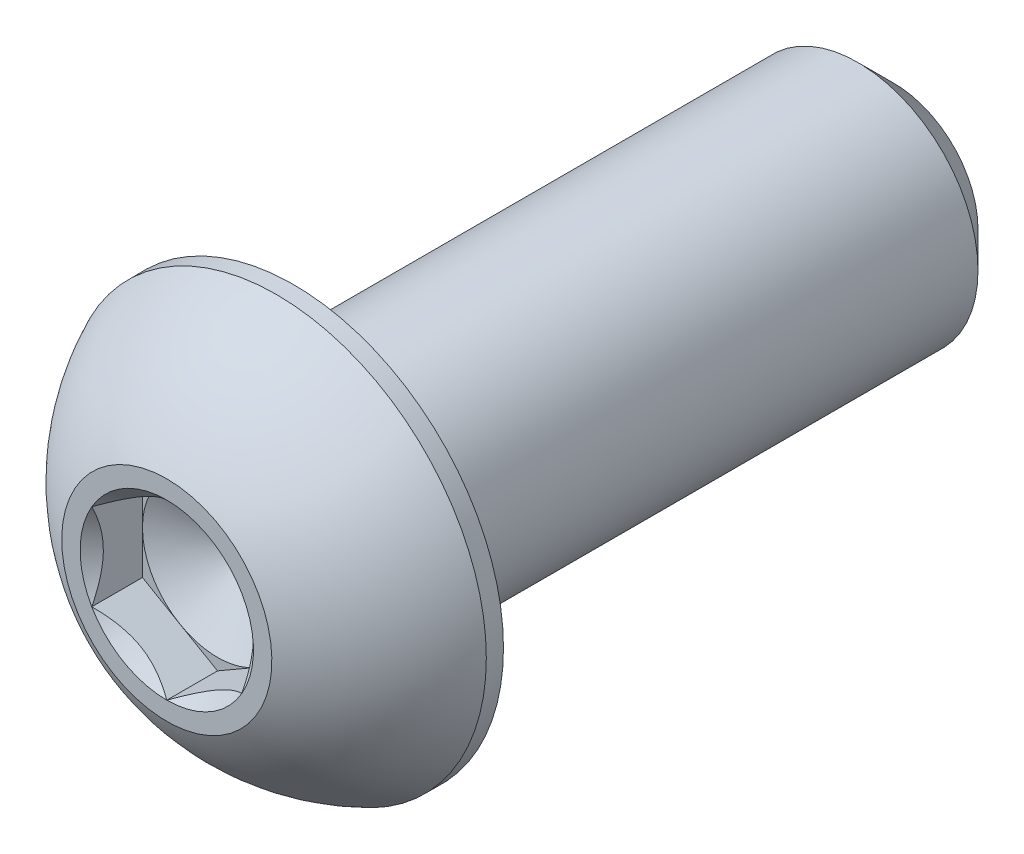
ISO-10303-21;
HEADER;
FILE_DESCRIPTION(('STEP AP214'),'2;1');
FILE_NAME('part.step','',(''),(''),'','','');
FILE_SCHEMA(('AUTOMOTIVE_DESIGN { 1 0 10303 214 1 1 1 1 }'));
ENDSEC;
DATA;
#1=APPLICATION_CONTEXT('core data for automotive mechanical design processes');
#2=APPLICATION_PROTOCOL_DEFINITION('international standard','automotive_design',2000,#1);
#3=PRODUCT_CONTEXT('',#1,'mechanical');
#4=PRODUCT('Part','Part','',(#3));
#5=PRODUCT_RELATED_PRODUCT_CATEGORY('part','',(#4));
#6=PRODUCT_DEFINITION_FORMATION('','',#4);
#7=PRODUCT_DEFINITION_CONTEXT('part definition',#1,'design');
#8=PRODUCT_DEFINITION('design','',#6,#7);
#9=PRODUCT_DEFINITION_SHAPE('','',#8);
#10=(LENGTH_UNIT() NAMED_UNIT(*) SI_UNIT(.MILLI.,.METRE.));
#11=(NAMED_UNIT(*) PLANE_ANGLE_UNIT() SI_UNIT($,.RADIAN.));
#12=(NAMED_UNIT(*) SI_UNIT($,.STERADIAN.) SOLID_ANGLE_UNIT());
#13=UNCERTAINTY_MEASURE_WITH_UNIT(LENGTH_MEASURE(1.E-05),#10,'distance_accuracy_value','');
#14=(GEOMETRIC_REPRESENTATION_CONTEXT(3) GLOBAL_UNCERTAINTY_ASSIGNED_CONTEXT((#13)) GLOBAL_UNIT_ASSIGNED_CONTEXT((#10,
#11,#12)) REPRESENTATION_CONTEXT('',''));
#15=CARTESIAN_POINT('',(0.,0.,0.));
#16=DIRECTION('',(0.,0.,1.));
#17=DIRECTION('',(1.,0.,0.));
#18=AXIS2_PLACEMENT_3D('',#15,#16,#17);
#19=CARTESIAN_POINT('',(0.,1.984375,9.6139));
#20=DIRECTION('',(0.,0.,-1.));
#21=DIRECTION('',(-1.,0.,0.));
#22=AXIS2_PLACEMENT_3D('',#19,#20,#21);
#23=PLANE('',#22);
#24=CARTESIAN_POINT('',(0.,0.,9.6139));
#25=DIRECTION('',(0.,0.,1.));
#26=DIRECTION('',(1.,0.,0.));
#27=AXIS2_PLACEMENT_3D('',#24,#25,#26);
#28=CIRCLE('',#27,2.778125);
#29=CARTESIAN_POINT('',(0.,2.778125,9.6139));
#30=VERTEX_POINT('',#29);
#31=EDGE_CURVE('E169',#30,#30,#28,.T.);
#32=ORIENTED_EDGE('',*,*,#31,.T.);
#33=EDGE_LOOP('',(#32));
#34=FACE_BOUND('',#33,.T.);
#35=CARTESIAN_POINT('',(0.,0.,9.6139));
#36=DIRECTION('',(0.,0.,1.));
#37=DIRECTION('',(1.,0.,0.));
#38=AXIS2_PLACEMENT_3D('',#35,#36,#37);
#39=CIRCLE('',#38,2.29135888084633);
#40=CARTESIAN_POINT('',(0.,2.29135888084633,9.6139));
#41=VERTEX_POINT('',#40);
#42=CARTESIAN_POINT('',(-1.984375,1.14567944042316,9.6139));
#43=VERTEX_POINT('',#42);
#44=EDGE_CURVE('E123',#41,#43,#39,.T.);
#45=ORIENTED_EDGE('',*,*,#44,.F.);
#46=CARTESIAN_POINT('',(0.,0.,9.6139));
#47=DIRECTION('',(0.,0.,1.));
#48=DIRECTION('',(1.,0.,0.));
#49=AXIS2_PLACEMENT_3D('',#46,#47,#48);
#50=CIRCLE('',#49,2.29135888084633);
#51=CARTESIAN_POINT('',(1.984375,1.14567944042316,9.6139));
#52=VERTEX_POINT('',#51);
#53=EDGE_CURVE('E108',#52,#41,#50,.T.);
#54=ORIENTED_EDGE('',*,*,#53,.F.);
#55=CARTESIAN_POINT('',(0.,0.,9.6139));
#56=DIRECTION('',(0.,0.,1.));
#57=DIRECTION('',(1.,0.,0.));
#58=AXIS2_PLACEMENT_3D('',#55,#56,#57);
#59=CIRCLE('',#58,2.29135888084633);
#60=CARTESIAN_POINT('',(1.984375,-1.14567944042316,9.6139));
#61=VERTEX_POINT('',#60);
#62=EDGE_CURVE('E119',#61,#52,#59,.T.);
#63=ORIENTED_EDGE('',*,*,#62,.F.);
#64=CARTESIAN_POINT('',(0.,0.,9.6139));
#65=DIRECTION('',(0.,0.,1.));
#66=DIRECTION('',(1.,0.,0.));
#67=AXIS2_PLACEMENT_3D('',#64,#65,#66);
#68=CIRCLE('',#67,2.29135888084633);
#69=CARTESIAN_POINT('',(0.,-2.29135888084633,9.6139));
#70=VERTEX_POINT('',#69);
#71=EDGE_CURVE('E140',#70,#61,#68,.T.);
#72=ORIENTED_EDGE('',*,*,#71,.F.);
#73=CARTESIAN_POINT('',(0.,0.,9.6139));
#74=DIRECTION('',(0.,0.,1.));
#75=DIRECTION('',(1.,0.,0.));
#76=AXIS2_PLACEMENT_3D('',#73,#74,#75);
#77=CIRCLE('',#76,2.29135888084633);
#78=CARTESIAN_POINT('',(-1.984375,-1.14567944042317,9.6139));
#79=VERTEX_POINT('',#78);
#80=EDGE_CURVE('E440',#79,#70,#77,.T.);
#81=ORIENTED_EDGE('',*,*,#80,.F.);
#82=CARTESIAN_POINT('',(0.,0.,9.6139));
#83=DIRECTION('',(0.,0.,1.));
#84=DIRECTION('',(1.,0.,0.));
#85=AXIS2_PLACEMENT_3D('',#82,#83,#84);
#86=CIRCLE('',#85,2.29135888084633);
#87=EDGE_CURVE('E449',#43,#79,#86,.T.);
#88=ORIENTED_EDGE('',*,*,#87,.F.);
#89=EDGE_LOOP('',(#45,#54,#63,#72,#81,#88));
#90=FACE_BOUND('',#89,.T.);
#91=ADVANCED_FACE('F35',(#34,#90),#23,.F.);
#92=CARTESIAN_POINT('',(0.,0.,-9.61389999999999));
#93=DIRECTION('',(0.,0.,1.));
#94=DIRECTION('',(1.,0.,0.));
#95=AXIS2_PLACEMENT_3D('',#92,#93,#94);
#96=CONICAL_SURFACE('',#95,2.2225,0.785398163397447);
#97=CARTESIAN_POINT('',(0.,0.,-8.6614));
#98=DIRECTION('',(0.,0.,1.));
#99=DIRECTION('',(1.,0.,0.));
#100=AXIS2_PLACEMENT_3D('',#97,#98,#99);
#101=CIRCLE('',#100,3.175);
#102=CARTESIAN_POINT('',(3.175,0.,-8.6614));
#103=VERTEX_POINT('',#102);
#104=EDGE_CURVE('E11',#103,#103,#101,.T.);
#105=ORIENTED_EDGE('',*,*,#104,.F.);
#106=EDGE_LOOP('',(#105));
#107=FACE_BOUND('',#106,.T.);
#108=CARTESIAN_POINT('',(0.,0.,-9.61389999999999));
#109=DIRECTION('',(0.,0.,1.));
#110=DIRECTION('',(1.,0.,0.));
#111=AXIS2_PLACEMENT_3D('',#108,#109,#110);
#112=CIRCLE('',#111,2.2225);
#113=CARTESIAN_POINT('',(2.2225,0.,-9.61389999999999));
#114=VERTEX_POINT('',#113);
#115=EDGE_CURVE('E162',#114,#114,#112,.T.);
#116=ORIENTED_EDGE('',*,*,#115,.T.);
#117=EDGE_LOOP('',(#116));
#118=FACE_BOUND('',#117,.T.);
#119=ADVANCED_FACE('F37',(#107,#118),#96,.T.);
#120=CARTESIAN_POINT('',(0.,0.,9.6139));
#121=DIRECTION('',(0.,0.,1.));
#122=DIRECTION('',(1.,0.,0.));
#123=AXIS2_PLACEMENT_3D('',#120,#121,#122);
#124=CYLINDRICAL_SURFACE('',#123,3.175);
#125=CARTESIAN_POINT('',(0.,0.,6.2611));
#126=DIRECTION('',(0.,0.,1.));
#127=DIRECTION('',(1.,0.,0.));
#128=AXIS2_PLACEMENT_3D('',#125,#126,#127);
#129=CIRCLE('',#128,3.175);
#130=CARTESIAN_POINT('',(3.175,0.,6.2611));
#131=VERTEX_POINT('',#130);
#132=EDGE_CURVE('E43',#131,#131,#129,.T.);
#133=ORIENTED_EDGE('',*,*,#132,.F.);
#134=EDGE_LOOP('',(#133));
#135=FACE_BOUND('',#134,.T.);
#136=ORIENTED_EDGE('',*,*,#104,.T.);
#137=EDGE_LOOP('',(#136));
#138=FACE_BOUND('',#137,.T.);
#139=ADVANCED_FACE('F183',(#135,#138),#124,.T.);
#140=CARTESIAN_POINT('',(0.,5.5499,6.2611));
#141=DIRECTION('',(0.,0.,1.));
#142=DIRECTION('',(1.,0.,0.));
#143=AXIS2_PLACEMENT_3D('',#140,#141,#142);
#144=PLANE('',#143);
#145=CARTESIAN_POINT('',(0.,0.,6.2611));
#146=DIRECTION('',(0.,0.,1.));
#147=DIRECTION('',(1.,0.,0.));
#148=AXIS2_PLACEMENT_3D('',#145,#146,#147);
#149=CIRCLE('',#148,5.5499);
#150=CARTESIAN_POINT('',(5.5499,0.,6.2611));
#151=VERTEX_POINT('',#150);
#152=EDGE_CURVE('E176',#151,#151,#149,.T.);
#153=ORIENTED_EDGE('',*,*,#152,.F.);
#154=EDGE_LOOP('',(#153));
#155=FACE_BOUND('',#154,.T.);
#156=ORIENTED_EDGE('',*,*,#132,.T.);
#157=EDGE_LOOP('',(#156));
#158=FACE_BOUND('',#157,.T.);
#159=ADVANCED_FACE('F181',(#155,#158),#144,.F.);
#160=CARTESIAN_POINT('',(0.,0.,9.6139));
#161=DIRECTION('',(0.,0.,1.));
#162=DIRECTION('',(1.,0.,0.));
#163=AXIS2_PLACEMENT_3D('',#160,#161,#162);
#164=CYLINDRICAL_SURFACE('',#163,5.5499);
#165=CARTESIAN_POINT('',(0.,0.,6.71467142857143));
#166=DIRECTION('',(0.,0.,1.));
#167=DIRECTION('',(1.,0.,0.));
#168=AXIS2_PLACEMENT_3D('',#165,#166,#167);
#169=CIRCLE('',#168,5.5499);
#170=CARTESIAN_POINT('',(0.,5.5499,6.71467142857143));
#171=VERTEX_POINT('',#170);
#172=EDGE_CURVE('E173',#171,#171,#169,.T.);
#173=ORIENTED_EDGE('',*,*,#172,.F.);
#174=EDGE_LOOP('',(#173));
#175=FACE_BOUND('',#174,.T.);
#176=ORIENTED_EDGE('',*,*,#152,.T.);
#177=EDGE_LOOP('',(#176));
#178=FACE_BOUND('',#177,.T.);
#179=ADVANCED_FACE('F202',(#175,#178),#164,.T.);
#180=CARTESIAN_POINT('',(0.,0.,4.18332820685455));
#181=DIRECTION('',(0.,0.,1.));
#182=DIRECTION('',(0.,1.,0.));
#183=AXIS2_PLACEMENT_3D('',#180,#181,#182);
#184=SPHERICAL_SURFACE('',#183,6.09992528775001);
#185=CARTESIAN_POINT('',(0.,2.778125,9.6139));
#186=CARTESIAN_POINT('',(0.,2.81602671338563,9.59451064772217));
#187=CARTESIAN_POINT('',(0.,2.85372537445918,9.57472438218914));
#188=CARTESIAN_POINT('',(0.,2.92870021164798,9.5343669699155));
#189=CARTESIAN_POINT('',(0.,2.96597638776324,9.51379582317489));
#190=CARTESIAN_POINT('',(0.,3.04008987470138,9.47187759378889));
#191=CARTESIAN_POINT('',(0.,3.07692718552427,9.45053051114351));
#192=CARTESIAN_POINT('',(0.,3.15014680356086,9.40706978760221));
#193=CARTESIAN_POINT('',(0.,3.18652911077458,9.3849561467063));
#194=CARTESIAN_POINT('',(0.,3.25882276944387,9.33997199565968));
#195=CARTESIAN_POINT('',(0.,3.29473412089944,9.31710148550897));
#196=CARTESIAN_POINT('',(0.,3.36607012592493,9.27061362336544));
#197=CARTESIAN_POINT('',(0.,3.40149477949484,9.24699627137263));
#198=CARTESIAN_POINT('',(0.,3.47184185902622,9.19902507858578));
#199=CARTESIAN_POINT('',(0.,3.50676428498768,9.17467123779175));
#200=CARTESIAN_POINT('',(0.,3.57609160000261,9.12523774378183));
#201=CARTESIAN_POINT('',(0.,3.61049648905608,9.10015809056595));
#202=CARTESIAN_POINT('',(0.,3.67877364776563,9.04928396614726));
#203=CARTESIAN_POINT('',(0.,3.71264591742172,9.02348949494445));
#204=CARTESIAN_POINT('',(0.,3.77984298835613,8.97119704238412));
#205=CARTESIAN_POINT('',(0.,3.81316778963445,8.94469906102659));
#206=CARTESIAN_POINT('',(0.,3.87925531482814,8.89101120438586));
#207=CARTESIAN_POINT('',(0.,3.91201803874352,8.86382132910267));
#208=CARTESIAN_POINT('',(0.,3.97696704663191,8.80876160415578));
#209=CARTESIAN_POINT('',(0.,4.00915333060493,8.78089175449209));
#210=CARTESIAN_POINT('',(0.,4.07293534872958,8.72448429841707));
#211=CARTESIAN_POINT('',(0.,4.10453108288122,8.69594669200573));
#212=CARTESIAN_POINT('',(0.,4.16711815037044,8.63821623280081));
#213=CARTESIAN_POINT('',(0.,4.19810948370802,8.60902338000723));
#214=CARTESIAN_POINT('',(0.,4.25947416353471,8.54999522565121));
#215=CARTESIAN_POINT('',(0.,4.28984751002382,8.52015992408876));
#216=CARTESIAN_POINT('',(0.,4.34996290103328,8.45985995144623));
#217=CARTESIAN_POINT('',(0.,4.37970494555363,8.42939528036614));
#218=CARTESIAN_POINT('',(0.,4.43854469425657,8.36784992384361));
#219=CARTESIAN_POINT('',(0.,4.46764239843916,8.33676923840117));
#220=CARTESIAN_POINT('',(0.,4.52518071056457,8.27400547835869));
#221=CARTESIAN_POINT('',(0.,4.55362131850739,8.24232240375865));
#222=CARTESIAN_POINT('',(0.,4.60983297031029,8.17836775468214));
#223=CARTESIAN_POINT('',(0.,4.63760401417035,8.14609618020565));
#224=CARTESIAN_POINT('',(0.,4.6924643634894,8.08097867864499));
#225=CARTESIAN_POINT('',(0.,4.71955366894838,8.04813275156081));
#226=CARTESIAN_POINT('',(0.,4.77303866600855,7.98188094383918));
#227=CARTESIAN_POINT('',(0.,4.79943435760973,7.94847506320173));
#228=CARTESIAN_POINT('',(0.,4.85152055556542,7.88111799290146));
#229=CARTESIAN_POINT('',(0.,4.87721106191991,7.84716680323865));
#230=CARTESIAN_POINT('',(0.,4.927875627133,7.77873399846878));
#231=CARTESIAN_POINT('',(0.,4.95284968599158,7.74425238336172));
#232=CARTESIAN_POINT('',(0.,5.00207040804361,7.67477384381449));
#233=CARTESIAN_POINT('',(0.,5.02631707123706,7.63977691937432));
#234=CARTESIAN_POINT('',(0.,5.0740723726572,7.56928310316971));
#235=CARTESIAN_POINT('',(0.,5.09758101088389,7.53378621140527));
#236=CARTESIAN_POINT('',(0.,5.1438499566405,7.46230802175431));
#237=CARTESIAN_POINT('',(0.,5.16661026417041,7.42632672386778));
#238=CARTESIAN_POINT('',(0.,5.21137257072764,7.35389549546688));
#239=CARTESIAN_POINT('',(0.,5.23337456975495,7.3174455649525));
#240=CARTESIAN_POINT('',(0.,5.276610614416,7.24409305046432));
#241=CARTESIAN_POINT('',(0.,5.29784466004975,7.20719046649051));
#242=CARTESIAN_POINT('',(0.,5.33953548787471,7.13294882181283));
#243=CARTESIAN_POINT('',(0.,5.35999227006592,7.09560976110895));
#244=CARTESIAN_POINT('',(0.,5.40011960846765,7.02051153430598));
#245=CARTESIAN_POINT('',(0.,5.41979016467818,6.98275236820689));
#246=CARTESIAN_POINT('',(0.,5.45833640797136,6.90683047394067));
#247=CARTESIAN_POINT('',(0.,5.47721209505402,6.86866774577356));
#248=CARTESIAN_POINT('',(0.,5.51416039973219,6.79195549304741));
#249=CARTESIAN_POINT('',(0.,5.53223301732771,6.75340596848837));
#250=CARTESIAN_POINT('',(0.,5.5499,6.71467142857143));
#251=B_SPLINE_CURVE_WITH_KNOTS('',3,(#185,#186,#187,#188,#189,#190,#191,#192,#193,#194,#195,
#196,#197,#198,#199,#200,#201,#202,#203,#204,#205,#206,#207,#208,#209,#210,#211,#212,#213,#214,
#215,#216,#217,#218,#219,#220,#221,#222,#223,#224,#225,#226,#227,#228,#229,#230,#231,#232,#233,
#234,#235,#236,#237,#238,#239,#240,#241,#242,#243,#244,#245,#246,#247,#248,#249,#250),
.UNSPECIFIED.,.F.,.F.,(4,2,2,2,2,2,2,2,2,2,2,2,2,2,2,2,2,2,2,2,2,2,2,2,2,2,2,2,2,2,2,2,4),(0.,
0.127717597491554,0.255435194983109,0.383152792474663,0.510870389966217,0.63858798745777,
0.766305584949326,0.894023182440878,1.02174077993243,1.14945837742399,1.27717597491554,
1.40489357240709,1.53261116989865,1.6603287673902,1.78804636488176,1.91576396237331,
2.04348155986487,2.17119915735642,2.29891675484797,2.42663435233953,2.55435194983108,
2.68206954732264,2.80978714481419,2.93750474230574,3.0652223397973,3.19293993728885,
3.32065753478041,3.44837513227196,3.57609272976351,3.70381032725507,3.83152792474662,
3.95924552223818,4.08696311972973),.UNSPECIFIED.);
#252=EDGE_CURVE('BSEAM194',#30,#171,#251,.T.);
#253=ORIENTED_EDGE('',*,*,#31,.F.);
#254=ORIENTED_EDGE('',*,*,#172,.T.);
#255=ORIENTED_EDGE('',*,*,#252,.T.);
#256=ORIENTED_EDGE('',*,*,#252,.F.);
#257=EDGE_LOOP('',(#253,#255,#254,#256));
#258=FACE_BOUND('',#257,.T.);
#259=ADVANCED_FACE('F194',(#258),#184,.T.);
#260=CARTESIAN_POINT('',(0.,2.2225,-9.6139));
#261=DIRECTION('',(0.,0.,1.));
#262=DIRECTION('',(1.,0.,0.));
#263=AXIS2_PLACEMENT_3D('',#260,#261,#262);
#264=PLANE('',#263);
#265=ORIENTED_EDGE('',*,*,#115,.F.);
#266=EDGE_LOOP('',(#265));
#267=FACE_BOUND('',#266,.T.);
#268=ADVANCED_FACE('F192',(#267),#264,.F.);
#269=CARTESIAN_POINT('',(1.984375,1.14567944042317,9.6139));
#270=DIRECTION('',(-0.499999999999999,-0.866025403784439,0.));
#271=DIRECTION('',(0.866025403784439,-0.499999999999999,0.));
#272=AXIS2_PLACEMENT_3D('',#269,#270,#271);
#273=PLANE('',#272);
#274=CARTESIAN_POINT('',(1.984575,1.14556397036933,9.61401547878184));
#275=CARTESIAN_POINT('',(1.9163590048332,1.18494849354192,9.57466285226391));
#276=CARTESIAN_POINT('',(1.84700231489303,1.22499159714897,9.53762131044619));
#277=CARTESIAN_POINT('',(1.70557619954781,1.30664400291398,9.46979885842332));
#278=CARTESIAN_POINT('',(1.63349332126322,1.34826107209555,9.43905568909175));
#279=CARTESIAN_POINT('',(1.48814160273399,1.43217992591558,9.38639188881121));
#280=CARTESIAN_POINT('',(1.41490978751306,1.47446033414663,9.36433887587996));
#281=CARTESIAN_POINT('',(1.26683381740529,1.55995203534886,9.33036149294388));
#282=CARTESIAN_POINT('',(1.19199418724657,1.60316071596705,9.31841175609173));
#283=CARTESIAN_POINT('',(1.06301458545618,1.6776271237807,9.3076300990819));
#284=CARTESIAN_POINT('',(1.00904128422756,1.7087886237741,9.30603389905907));
#285=CARTESIAN_POINT('',(0.901182881480197,1.77106070163465,9.30872183886529));
#286=CARTESIAN_POINT('',(0.847297817514474,1.80217125782056,9.31300804034046));
#287=CARTESIAN_POINT('',(0.740036461751393,1.86409863044402,9.32721687301352));
#288=CARTESIAN_POINT('',(0.686660807239857,1.89491507894443,9.33714581045227));
#289=CARTESIAN_POINT('',(0.580832482591101,1.95601509066828,9.36209508427454));
#290=CARTESIAN_POINT('',(0.528379742028895,1.9862986945516,9.37711503038949));
#291=CARTESIAN_POINT('',(0.394017661036349,2.06387267818152,9.42170785163567));
#292=CARTESIAN_POINT('',(0.312941642841674,2.11068193911104,9.45464299593833));
#293=CARTESIAN_POINT('',(0.193726693270159,2.17951072233758,9.5102424412022));
#294=CARTESIAN_POINT('',(0.154440075613998,2.20219286161692,9.52977759205186));
#295=CARTESIAN_POINT('',(0.0765946381319466,2.24713694590237,9.5706287381194));
#296=CARTESIAN_POINT('',(0.0380353888983006,2.26939913882716,9.59194363956835));
#297=CARTESIAN_POINT('',(-0.000200000000000683,2.29147435090016,9.61401547878184));
#298=B_SPLINE_CURVE_WITH_KNOTS('',3,(#274,#275,#276,#277,#278,#279,#280,#281,#282,#283,#284,
#285,#286,#287,#288,#289,#290,#291,#292,#293,#294,#295,#296,#297),.UNSPECIFIED.,.F.,.F.,(4,2,2,
2,2,2,2,2,2,2,2,4),(0.,0.264339630306627,0.530219665093696,0.791876416371462,1.05287424418109,
1.239639843932,1.42647091743852,1.61351120244035,1.80053715247541,2.09764209964316,
2.24579179873713,2.39385111134157),.UNSPECIFIED.);
#299=EDGE_CURVE('E105',#52,#41,#298,.T.);
#300=ORIENTED_EDGE('',*,*,#299,.T.);
#301=DIRECTION('',(0.,0.,-1.));
#302=VECTOR('',#301,1.);
#303=CARTESIAN_POINT('',(0.,2.29135888084633,9.6139));
#304=LINE('',#303,#302);
#305=CARTESIAN_POINT('',(0.,2.29135888084633,8.27278));
#306=VERTEX_POINT('',#305);
#307=EDGE_CURVE('E160',#41,#306,#304,.T.);
#308=ORIENTED_EDGE('',*,*,#307,.T.);
#309=DIRECTION('',(-0.866025403784439,0.499999999999999,0.));
#310=VECTOR('',#309,1.);
#311=CARTESIAN_POINT('',(1.984375,1.14567944042317,8.27278));
#312=LINE('',#311,#310);
#313=CARTESIAN_POINT('',(0.992187499999999,1.71851916063475,8.27278));
#314=VERTEX_POINT('',#313);
#315=EDGE_CURVE('E476',#314,#306,#312,.T.);
#316=ORIENTED_EDGE('',*,*,#315,.F.);
#317=CARTESIAN_POINT('',(1.984375,1.14567944042317,8.27278));
#318=VERTEX_POINT('',#317);
#319=EDGE_CURVE('E50',#318,#314,#312,.T.);
#320=ORIENTED_EDGE('',*,*,#319,.F.);
#321=DIRECTION('',(0.,0.,-1.));
#322=VECTOR('',#321,1.);
#323=CARTESIAN_POINT('',(1.984375,1.14567944042317,9.6139));
#324=LINE('',#323,#322);
#325=EDGE_CURVE('E136',#52,#318,#324,.T.);
#326=ORIENTED_EDGE('',*,*,#325,.F.);
#327=EDGE_LOOP('',(#300,#308,#316,#320,#326));
#328=FACE_BOUND('',#327,.T.);
#329=ADVANCED_FACE('F142',(#328),#273,.T.);
#330=CARTESIAN_POINT('',(0.,2.29135888084633,9.6139));
#331=DIRECTION('',(0.5,-0.866025403784438,0.));
#332=DIRECTION('',(0.866025403784438,0.5,0.));
#333=AXIS2_PLACEMENT_3D('',#330,#331,#332);
#334=PLANE('',#333);
#335=CARTESIAN_POINT('',(0.000199999999998464,2.29147435090016,9.61401547878184));
#336=CARTESIAN_POINT('',(-0.0680159951668045,2.25208982772757,9.57466285226391));
#337=CARTESIAN_POINT('',(-0.137372685106968,2.21204672412052,9.53762131044619));
#338=CARTESIAN_POINT('',(-0.278798800452189,2.13039431835551,9.46979885842332));
#339=CARTESIAN_POINT('',(-0.350881678736784,2.08877724917394,9.43905568909175));
#340=CARTESIAN_POINT('',(-0.496233397266005,2.00485839535392,9.38639188881121));
#341=CARTESIAN_POINT('',(-0.56946521248694,1.96257798712287,9.36433887587996));
#342=CARTESIAN_POINT('',(-0.717541182594707,1.87708628592063,9.33036149294388));
#343=CARTESIAN_POINT('',(-0.792380812753425,1.83387760530244,9.31841175609173));
#344=CARTESIAN_POINT('',(-0.921360414543816,1.75941119748879,9.3076300990819));
#345=CARTESIAN_POINT('',(-0.975333715772443,1.72824969749539,9.30603389905907));
#346=CARTESIAN_POINT('',(-1.0831921185198,1.66597761963484,9.30872183886529));
#347=CARTESIAN_POINT('',(-1.13707718248552,1.63486706344893,9.31300804034046));
#348=CARTESIAN_POINT('',(-1.2443385382486,1.57293969082547,9.32721687301352));
#349=CARTESIAN_POINT('',(-1.29771419276014,1.54212324232506,9.33714581045227));
#350=CARTESIAN_POINT('',(-1.4035425174089,1.48102323060122,9.36209508427454));
#351=CARTESIAN_POINT('',(-1.4559952579711,1.45073962671789,9.37711503038949));
#352=CARTESIAN_POINT('',(-1.59035733896365,1.37316564308797,9.42170785163567));
#353=CARTESIAN_POINT('',(-1.67143335715833,1.32635638215845,9.45464299593833));
#354=CARTESIAN_POINT('',(-1.79064830672984,1.25752759893191,9.5102424412022));
#355=CARTESIAN_POINT('',(-1.829934924386,1.23484545965257,9.52977759205186));
#356=CARTESIAN_POINT('',(-1.90778036186805,1.18990137536712,9.5706287381194));
#357=CARTESIAN_POINT('',(-1.9463396111017,1.16763918244233,9.59194363956835));
#358=CARTESIAN_POINT('',(-1.984575,1.14556397036933,9.61401547878184));
#359=B_SPLINE_CURVE_WITH_KNOTS('',3,(#335,#336,#337,#338,#339,#340,#341,#342,#343,#344,#345,
#346,#347,#348,#349,#350,#351,#352,#353,#354,#355,#356,#357,#358),.UNSPECIFIED.,.F.,.F.,(4,2,2,
2,2,2,2,2,2,2,2,4),(0.,0.264339630306626,0.530219665093694,0.79187641637146,1.05287424418109,
1.239639843932,1.42647091743852,1.61351120244035,1.8005371524754,2.09764209964316,
2.24579179873714,2.39385111134157),.UNSPECIFIED.);
#360=EDGE_CURVE('E464',#41,#43,#359,.T.);
#361=ORIENTED_EDGE('',*,*,#360,.T.);
#362=DIRECTION('',(0.,0.,-1.));
#363=VECTOR('',#362,1.);
#364=CARTESIAN_POINT('',(-1.984375,1.14567944042316,9.6139));
#365=LINE('',#364,#363);
#366=CARTESIAN_POINT('',(-1.984375,1.14567944042316,8.27278));
#367=VERTEX_POINT('',#366);
#368=EDGE_CURVE('E157',#43,#367,#365,.T.);
#369=ORIENTED_EDGE('',*,*,#368,.T.);
#370=DIRECTION('',(-0.866025403784438,-0.5,0.));
#371=VECTOR('',#370,1.);
#372=CARTESIAN_POINT('',(0.,2.29135888084633,8.27278));
#373=LINE('',#372,#371);
#374=CARTESIAN_POINT('',(-0.992187500000001,1.71851916063474,8.27278));
#375=VERTEX_POINT('',#374);
#376=EDGE_CURVE('E478',#375,#367,#373,.T.);
#377=ORIENTED_EDGE('',*,*,#376,.F.);
#378=EDGE_CURVE('E479',#306,#375,#373,.T.);
#379=ORIENTED_EDGE('',*,*,#378,.F.);
#380=ORIENTED_EDGE('',*,*,#307,.F.);
#381=EDGE_LOOP('',(#361,#369,#377,#379,#380));
#382=FACE_BOUND('',#381,.T.);
#383=ADVANCED_FACE('F200',(#382),#334,.T.);
#384=CARTESIAN_POINT('',(-1.984375,1.14567944042316,9.6139));
#385=DIRECTION('',(1.,0.,0.));
#386=DIRECTION('',(0.,0.,-1.));
#387=AXIS2_PLACEMENT_3D('',#384,#385,#386);
#388=PLANE('',#387);
#389=CARTESIAN_POINT('',(-1.984375,-2.24664989492636,10.3200700833169));
#390=CARTESIAN_POINT('',(-1.984375,-2.19177035879913,10.2789466992886));
#391=CARTESIAN_POINT('',(-1.984375,-2.1365793309425,10.2382329661326));
#392=CARTESIAN_POINT('',(-1.984375,-2.0254530694156,10.1578048670618));
#393=CARTESIAN_POINT('',(-1.984375,-1.96951764844329,10.1180907602265));
#394=CARTESIAN_POINT('',(-1.984375,-1.85637247000972,10.0395599960499));
#395=CARTESIAN_POINT('',(-1.984375,-1.79915619451491,10.0007526850202));
#396=CARTESIAN_POINT('',(-1.984375,-1.68374612486123,9.92463116655778));
#397=CARTESIAN_POINT('',(-1.984375,-1.62555240093273,9.88731685249807));
#398=CARTESIAN_POINT('',(-1.984375,-1.44283684202776,9.77406794235898));
#399=CARTESIAN_POINT('',(-1.984375,-1.31636516124235,9.70122141910062));
#400=CARTESIAN_POINT('',(-1.984375,-1.05716498260296,9.56821175577765));
#401=CARTESIAN_POINT('',(-1.984375,-0.924459462264122,9.50800591965465));
#402=CARTESIAN_POINT('',(-1.984375,-0.724893074141588,9.43436183961541));
#403=CARTESIAN_POINT('',(-1.984375,-0.660907572248813,9.41316291748558));
#404=CARTESIAN_POINT('',(-1.984375,-0.531425551080248,9.37590711479737));
#405=CARTESIAN_POINT('',(-1.984375,-0.465928924835295,9.35985059946328));
#406=CARTESIAN_POINT('',(-1.984375,-0.334891945890407,9.33397084345925));
#407=CARTESIAN_POINT('',(-1.984375,-0.269372555502922,9.32404310154837));
#408=CARTESIAN_POINT('',(-1.984375,-0.137675185771463,9.31060859031056));
#409=CARTESIAN_POINT('',(-1.984375,-0.0714973135780649,9.30710079294676));
#410=CARTESIAN_POINT('',(-1.984375,0.0586431546448463,9.30675164823735));
#411=CARTESIAN_POINT('',(-1.984375,0.122605247687117,9.30968962459112));
#412=CARTESIAN_POINT('',(-1.984375,0.249962419599663,9.32159170918258));
#413=CARTESIAN_POINT('',(-1.984375,0.313357441624569,9.33055641485244));
#414=CARTESIAN_POINT('',(-1.984375,0.440194078343453,9.35418115034761));
#415=CARTESIAN_POINT('',(-1.984375,0.503617615772963,9.36893679973638));
#416=CARTESIAN_POINT('',(-1.984375,0.629083701047627,9.4033707574727));
#417=CARTESIAN_POINT('',(-1.984375,0.691126376772747,9.42304860789798));
#418=CARTESIAN_POINT('',(-1.984375,0.888252191671363,9.49292518633261));
#419=CARTESIAN_POINT('',(-1.984375,1.02048040542615,9.55115558934036));
#420=CARTESIAN_POINT('',(-1.984375,1.27871806100267,9.68056918027673));
#421=CARTESIAN_POINT('',(-1.984375,1.40470281207756,9.75179927195745));
#422=CARTESIAN_POINT('',(-1.984375,1.5867785992022,9.86291293194116));
#423=CARTESIAN_POINT('',(-1.984375,1.64484387516129,9.89962382489262));
#424=CARTESIAN_POINT('',(-1.984375,1.75997827817988,9.97458744763746));
#425=CARTESIAN_POINT('',(-1.984375,1.81704732901584,10.0128402946748));
#426=CARTESIAN_POINT('',(-1.984375,1.92985499213403,10.0902867819938));
#427=CARTESIAN_POINT('',(-1.984375,1.98560066211377,10.1294701932287));
#428=CARTESIAN_POINT('',(-1.984375,2.09633159947626,10.2088666099261));
#429=CARTESIAN_POINT('',(-1.984375,2.15131707145808,10.2490793297131));
#430=CARTESIAN_POINT('',(-1.984375,2.20598450458982,10.28971347261));
#431=B_SPLINE_CURVE_WITH_KNOTS('',3,(#389,#390,#391,#392,#393,#394,#395,#396,#397,#398,#399,
#400,#401,#402,#403,#404,#405,#406,#407,#408,#409,#410,#411,#412,#413,#414,#415,#416,#417,#418,
#419,#420,#421,#422,#423,#424,#425,#426,#427,#428,#429,#430),.UNSPECIFIED.,.F.,.F.,(4,2,2,2,2,2,
2,2,2,2,2,2,2,2,2,2,2,2,2,2,4),(0.,0.205736210356766,0.411525204809809,0.618909845914798,
0.826279649489809,1.26374370453551,1.69970549535382,1.90175047418286,2.10380979948048,
2.3023211047986,2.50080061937433,2.69259135253523,2.88440110079442,3.07952109080018,
3.27462293514803,3.70679897011889,4.14056631296021,4.34663769336143,4.552724772271,
4.7571295110882,4.96147812147718),.UNSPECIFIED.);
#432=EDGE_CURVE('E457',#43,#79,#431,.F.);
#433=ORIENTED_EDGE('',*,*,#432,.T.);
#434=DIRECTION('',(0.,0.,-1.));
#435=VECTOR('',#434,1.);
#436=CARTESIAN_POINT('',(-1.984375,-1.14567944042316,9.6139));
#437=LINE('',#436,#435);
#438=CARTESIAN_POINT('',(-1.984375,-1.14567944042316,8.27278));
#439=VERTEX_POINT('',#438);
#440=EDGE_CURVE('E154',#79,#439,#437,.T.);
#441=ORIENTED_EDGE('',*,*,#440,.T.);
#442=DIRECTION('',(0.,-1.,0.));
#443=VECTOR('',#442,1.);
#444=CARTESIAN_POINT('',(-1.984375,1.14567944042316,8.27278));
#445=LINE('',#444,#443);
#446=CARTESIAN_POINT('',(-1.984375,0.,8.27278));
#447=VERTEX_POINT('',#446);
#448=EDGE_CURVE('E482',#447,#439,#445,.T.);
#449=ORIENTED_EDGE('',*,*,#448,.F.);
#450=EDGE_CURVE('E483',#367,#447,#445,.T.);
#451=ORIENTED_EDGE('',*,*,#450,.F.);
#452=ORIENTED_EDGE('',*,*,#368,.F.);
#453=EDGE_LOOP('',(#433,#441,#449,#451,#452));
#454=FACE_BOUND('',#453,.T.);
#455=ADVANCED_FACE('F321',(#454),#388,.T.);
#456=CARTESIAN_POINT('',(-1.984375,-1.14567944042316,9.6139));
#457=DIRECTION('',(0.5,0.866025403784439,0.));
#458=DIRECTION('',(-0.866025403784439,0.5,0.));
#459=AXIS2_PLACEMENT_3D('',#456,#457,#458);
#460=PLANE('',#459);
#461=CARTESIAN_POINT('',(-1.984575,-1.14556397036933,9.61401547878184));
#462=CARTESIAN_POINT('',(-1.9163590048332,-1.18494849354192,9.57466285226391));
#463=CARTESIAN_POINT('',(-1.84700231489303,-1.22499159714897,9.53762131044619));
#464=CARTESIAN_POINT('',(-1.70557619954781,-1.30664400291398,9.46979885842332));
#465=CARTESIAN_POINT('',(-1.63349332126322,-1.34826107209555,9.43905568909175));
#466=CARTESIAN_POINT('',(-1.488141602734,-1.43217992591557,9.38639188881121));
#467=CARTESIAN_POINT('',(-1.41490978751306,-1.47446033414663,9.36433887587996));
#468=CARTESIAN_POINT('',(-1.26683381740529,-1.55995203534886,9.33036149294388));
#469=CARTESIAN_POINT('',(-1.19199418724657,-1.60316071596705,9.31841175609173));
#470=CARTESIAN_POINT('',(-1.06301458545618,-1.6776271237807,9.3076300990819));
#471=CARTESIAN_POINT('',(-1.00904128422756,-1.7087886237741,9.30603389905907));
#472=CARTESIAN_POINT('',(-0.901182881480198,-1.77106070163465,9.30872183886529));
#473=CARTESIAN_POINT('',(-0.847297817514475,-1.80217125782056,9.31300804034046));
#474=CARTESIAN_POINT('',(-0.740036461751395,-1.86409863044402,9.32721687301352));
#475=CARTESIAN_POINT('',(-0.686660807239858,-1.89491507894443,9.33714581045227));
#476=CARTESIAN_POINT('',(-0.580832482591102,-1.95601509066828,9.36209508427454));
#477=CARTESIAN_POINT('',(-0.528379742028897,-1.9862986945516,9.37711503038949));
#478=CARTESIAN_POINT('',(-0.394017661036349,-2.06387267818152,9.42170785163567));
#479=CARTESIAN_POINT('',(-0.312941642841674,-2.11068193911104,9.45464299593833));
#480=CARTESIAN_POINT('',(-0.193726693270159,-2.17951072233758,9.5102424412022));
#481=CARTESIAN_POINT('',(-0.154440075613997,-2.20219286161692,9.52977759205186));
#482=CARTESIAN_POINT('',(-0.0765946381319457,-2.24713694590237,9.5706287381194));
#483=CARTESIAN_POINT('',(-0.0380353888983001,-2.26939913882716,9.59194363956835));
#484=CARTESIAN_POINT('',(0.000200000000001089,-2.29147435090017,9.61401547878184));
#485=B_SPLINE_CURVE_WITH_KNOTS('',3,(#461,#462,#463,#464,#465,#466,#467,#468,#469,#470,#471,
#472,#473,#474,#475,#476,#477,#478,#479,#480,#481,#482,#483,#484),.UNSPECIFIED.,.F.,.F.,(4,2,2,
2,2,2,2,2,2,2,2,4),(0.,0.264339630306627,0.530219665093694,0.791876416371461,1.05287424418109,
1.239639843932,1.42647091743852,1.61351120244035,1.8005371524754,2.09764209964316,
2.24579179873714,2.39385111134157),.UNSPECIFIED.);
#486=EDGE_CURVE('E442',#79,#70,#485,.T.);
#487=ORIENTED_EDGE('',*,*,#486,.T.);
#488=DIRECTION('',(0.,0.,-1.));
#489=VECTOR('',#488,1.);
#490=CARTESIAN_POINT('',(0.,-2.29135888084633,9.6139));
#491=LINE('',#490,#489);
#492=CARTESIAN_POINT('',(0.,-2.29135888084633,8.27278));
#493=VERTEX_POINT('',#492);
#494=EDGE_CURVE('E145',#70,#493,#491,.T.);
#495=ORIENTED_EDGE('',*,*,#494,.T.);
#496=DIRECTION('',(0.866025403784439,-0.5,0.));
#497=VECTOR('',#496,1.);
#498=CARTESIAN_POINT('',(-1.984375,-1.14567944042316,8.27278));
#499=LINE('',#498,#497);
#500=CARTESIAN_POINT('',(-0.992187499999999,-1.71851916063475,8.27278));
#501=VERTEX_POINT('',#500);
#502=EDGE_CURVE('E486',#501,#493,#499,.T.);
#503=ORIENTED_EDGE('',*,*,#502,.F.);
#504=EDGE_CURVE('E487',#439,#501,#499,.T.);
#505=ORIENTED_EDGE('',*,*,#504,.F.);
#506=ORIENTED_EDGE('',*,*,#440,.F.);
#507=EDGE_LOOP('',(#487,#495,#503,#505,#506));
#508=FACE_BOUND('',#507,.T.);
#509=ADVANCED_FACE('F331',(#508),#460,.T.);
#510=CARTESIAN_POINT('',(0.,-2.29135888084633,9.6139));
#511=DIRECTION('',(-0.5,0.866025403784438,0.));
#512=DIRECTION('',(-0.866025403784438,-0.5,0.));
#513=AXIS2_PLACEMENT_3D('',#510,#511,#512);
#514=PLANE('',#513);
#515=CARTESIAN_POINT('',(-0.000199999999998279,-2.29147435090016,9.61401547878184));
#516=CARTESIAN_POINT('',(0.0680159951668041,-2.25208982772757,9.57466285226391));
#517=CARTESIAN_POINT('',(0.137372685106967,-2.21204672412052,9.53762131044619));
#518=CARTESIAN_POINT('',(0.278798800452189,-2.13039431835551,9.46979885842332));
#519=CARTESIAN_POINT('',(0.350881678736783,-2.08877724917394,9.43905568909175));
#520=CARTESIAN_POINT('',(0.496233397266004,-2.00485839535392,9.38639188881121));
#521=CARTESIAN_POINT('',(0.569465212486939,-1.96257798712287,9.36433887587996));
#522=CARTESIAN_POINT('',(0.717541182594706,-1.87708628592063,9.33036149294388));
#523=CARTESIAN_POINT('',(0.792380812753425,-1.83387760530244,9.31841175609173));
#524=CARTESIAN_POINT('',(0.921360414543816,-1.75941119748879,9.30763009908191));
#525=CARTESIAN_POINT('',(0.975333715772442,-1.72824969749539,9.30603389905907));
#526=CARTESIAN_POINT('',(1.0831921185198,-1.66597761963484,9.30872183886529));
#527=CARTESIAN_POINT('',(1.13707718248552,-1.63486706344893,9.31300804034046));
#528=CARTESIAN_POINT('',(1.2443385382486,-1.57293969082547,9.32721687301352));
#529=CARTESIAN_POINT('',(1.29771419276014,-1.54212324232506,9.33714581045227));
#530=CARTESIAN_POINT('',(1.4035425174089,-1.48102323060122,9.36209508427454));
#531=CARTESIAN_POINT('',(1.4559952579711,-1.45073962671789,9.37711503038949));
#532=CARTESIAN_POINT('',(1.59035733896365,-1.37316564308797,9.42170785163567));
#533=CARTESIAN_POINT('',(1.67143335715832,-1.32635638215845,9.45464299593833));
#534=CARTESIAN_POINT('',(1.79064830672984,-1.25752759893191,9.5102424412022));
#535=CARTESIAN_POINT('',(1.829934924386,-1.23484545965257,9.52977759205186));
#536=CARTESIAN_POINT('',(1.90778036186805,-1.18990137536713,9.5706287381194));
#537=CARTESIAN_POINT('',(1.9463396111017,-1.16763918244233,9.59194363956835));
#538=CARTESIAN_POINT('',(1.984575,-1.14556397036933,9.61401547878184));
#539=B_SPLINE_CURVE_WITH_KNOTS('',3,(#515,#516,#517,#518,#519,#520,#521,#522,#523,#524,#525,
#526,#527,#528,#529,#530,#531,#532,#533,#534,#535,#536,#537,#538),.UNSPECIFIED.,.F.,.F.,(4,2,2,
2,2,2,2,2,2,2,2,4),(0.,0.264339630306626,0.530219665093692,0.791876416371459,1.05287424418109,
1.239639843932,1.42647091743852,1.61351120244034,1.8005371524754,2.09764209964316,
2.24579179873713,2.39385111134157),.UNSPECIFIED.);
#540=EDGE_CURVE('E433',#70,#61,#539,.T.);
#541=ORIENTED_EDGE('',*,*,#540,.T.);
#542=DIRECTION('',(0.,0.,-1.));
#543=VECTOR('',#542,1.);
#544=CARTESIAN_POINT('',(1.984375,-1.14567944042316,9.6139));
#545=LINE('',#544,#543);
#546=CARTESIAN_POINT('',(1.984375,-1.14567944042316,8.27278));
#547=VERTEX_POINT('',#546);
#548=EDGE_CURVE('E139',#61,#547,#545,.T.);
#549=ORIENTED_EDGE('',*,*,#548,.T.);
#550=DIRECTION('',(0.866025403784438,0.5,0.));
#551=VECTOR('',#550,1.);
#552=CARTESIAN_POINT('',(0.,-2.29135888084633,8.27278));
#553=LINE('',#552,#551);
#554=CARTESIAN_POINT('',(0.992187500000001,-1.71851916063475,8.27278));
#555=VERTEX_POINT('',#554);
#556=EDGE_CURVE('E489',#555,#547,#553,.T.);
#557=ORIENTED_EDGE('',*,*,#556,.F.);
#558=EDGE_CURVE('E490',#493,#555,#553,.T.);
#559=ORIENTED_EDGE('',*,*,#558,.F.);
#560=ORIENTED_EDGE('',*,*,#494,.F.);
#561=EDGE_LOOP('',(#541,#549,#557,#559,#560));
#562=FACE_BOUND('',#561,.T.);
#563=ADVANCED_FACE('F341',(#562),#514,.T.);
#564=CARTESIAN_POINT('',(1.984375,-1.14567944042316,9.6139));
#565=DIRECTION('',(-1.,0.,0.));
#566=DIRECTION('',(0.,-1.,0.));
#567=AXIS2_PLACEMENT_3D('',#564,#565,#566);
#568=PLANE('',#567);
#569=CARTESIAN_POINT('',(1.984375,-2.24664989492636,10.3200700833169));
#570=CARTESIAN_POINT('',(1.984375,-2.19177035879913,10.2789466992886));
#571=CARTESIAN_POINT('',(1.984375,-2.1365793309425,10.2382329661326));
#572=CARTESIAN_POINT('',(1.984375,-2.0254530694156,10.1578048670618));
#573=CARTESIAN_POINT('',(1.984375,-1.96951764844329,10.1180907602265));
#574=CARTESIAN_POINT('',(1.984375,-1.85637247000972,10.0395599960499));
#575=CARTESIAN_POINT('',(1.984375,-1.79915619451491,10.0007526850202));
#576=CARTESIAN_POINT('',(1.984375,-1.68374612486123,9.92463116655778));
#577=CARTESIAN_POINT('',(1.984375,-1.62555240093272,9.88731685249807));
#578=CARTESIAN_POINT('',(1.984375,-1.44283684202776,9.77406794235897));
#579=CARTESIAN_POINT('',(1.984375,-1.31636516124235,9.70122141910061));
#580=CARTESIAN_POINT('',(1.984375,-1.05716498260296,9.56821175577765));
#581=CARTESIAN_POINT('',(1.984375,-0.924459462264121,9.50800591965465));
#582=CARTESIAN_POINT('',(1.984375,-0.724893074141587,9.43436183961541));
#583=CARTESIAN_POINT('',(1.984375,-0.660907572248812,9.41316291748558));
#584=CARTESIAN_POINT('',(1.984375,-0.531425551080246,9.37590711479737));
#585=CARTESIAN_POINT('',(1.984375,-0.465928924835294,9.35985059946328));
#586=CARTESIAN_POINT('',(1.984375,-0.334891945890405,9.33397084345925));
#587=CARTESIAN_POINT('',(1.984375,-0.26937255550292,9.32404310154837));
#588=CARTESIAN_POINT('',(1.984375,-0.137675185771461,9.31060859031056));
#589=CARTESIAN_POINT('',(1.984375,-0.071497313578063,9.30710079294676));
#590=CARTESIAN_POINT('',(1.984375,0.0586431546448478,9.30675164823735));
#591=CARTESIAN_POINT('',(1.984375,0.122605247687118,9.30968962459112));
#592=CARTESIAN_POINT('',(1.984375,0.249962419599664,9.32159170918258));
#593=CARTESIAN_POINT('',(1.984375,0.31335744162457,9.33055641485244));
#594=CARTESIAN_POINT('',(1.984375,0.440194078343455,9.35418115034761));
#595=CARTESIAN_POINT('',(1.984375,0.503617615772964,9.36893679973638));
#596=CARTESIAN_POINT('',(1.984375,0.629083701047629,9.4033707574727));
#597=CARTESIAN_POINT('',(1.984375,0.691126376772749,9.42304860789798));
#598=CARTESIAN_POINT('',(1.984375,0.888252191671363,9.49292518633261));
#599=CARTESIAN_POINT('',(1.984375,1.02048040542615,9.55115558934036));
#600=CARTESIAN_POINT('',(1.984375,1.27871806100267,9.68056918027673));
#601=CARTESIAN_POINT('',(1.984375,1.40470281207756,9.75179927195745));
#602=CARTESIAN_POINT('',(1.984375,1.5867785992022,9.86291293194116));
#603=CARTESIAN_POINT('',(1.984375,1.64484387516129,9.89962382489262));
#604=CARTESIAN_POINT('',(1.984375,1.75997827817988,9.97458744763746));
#605=CARTESIAN_POINT('',(1.984375,1.81704732901584,10.0128402946748));
#606=CARTESIAN_POINT('',(1.984375,1.92985499213404,10.0902867819938));
#607=CARTESIAN_POINT('',(1.984375,1.98560066211377,10.1294701932287));
#608=CARTESIAN_POINT('',(1.984375,2.09633159947627,10.2088666099261));
#609=CARTESIAN_POINT('',(1.984375,2.15131707145809,10.2490793297131));
#610=CARTESIAN_POINT('',(1.984375,2.20598450458982,10.28971347261));
#611=B_SPLINE_CURVE_WITH_KNOTS('',3,(#569,#570,#571,#572,#573,#574,#575,#576,#577,#578,#579,
#580,#581,#582,#583,#584,#585,#586,#587,#588,#589,#590,#591,#592,#593,#594,#595,#596,#597,#598,
#599,#600,#601,#602,#603,#604,#605,#606,#607,#608,#609,#610),.UNSPECIFIED.,.F.,.F.,(4,2,2,2,2,2,
2,2,2,2,2,2,2,2,2,2,2,2,2,2,4),(0.,0.205736210356767,0.411525204809812,0.6189098459148,
0.826279649489811,1.26374370453551,1.69970549535382,1.90175047418286,2.10380979948048,
2.3023211047986,2.50080061937433,2.69259135253523,2.88440110079442,3.07952109080018,
3.27462293514803,3.70679897011889,4.14056631296021,4.34663769336143,4.55272477227101,
4.7571295110882,4.96147812147718),.UNSPECIFIED.);
#612=EDGE_CURVE('E129',#61,#52,#611,.T.);
#613=ORIENTED_EDGE('',*,*,#612,.T.);
#614=ORIENTED_EDGE('',*,*,#325,.T.);
#615=DIRECTION('',(0.,1.,0.));
#616=VECTOR('',#615,1.);
#617=CARTESIAN_POINT('',(1.984375,-1.14567944042316,8.27278));
#618=LINE('',#617,#616);
#619=CARTESIAN_POINT('',(1.984375,0.,8.27278));
#620=VERTEX_POINT('',#619);
#621=EDGE_CURVE('E148',#620,#318,#618,.T.);
#622=ORIENTED_EDGE('',*,*,#621,.F.);
#623=EDGE_CURVE('E143',#547,#620,#618,.T.);
#624=ORIENTED_EDGE('',*,*,#623,.F.);
#625=ORIENTED_EDGE('',*,*,#548,.F.);
#626=EDGE_LOOP('',(#613,#614,#622,#624,#625));
#627=FACE_BOUND('',#626,.T.);
#628=ADVANCED_FACE('F134',(#627),#568,.T.);
#629=CARTESIAN_POINT('',(0.,0.,8.27278));
#630=DIRECTION('',(0.,0.,1.));
#631=DIRECTION('',(1.,0.,0.));
#632=AXIS2_PLACEMENT_3D('',#629,#630,#631);
#633=PLANE('',#632);
#634=CARTESIAN_POINT('',(0.,0.,8.27278));
#635=DIRECTION('',(0.,0.,1.));
#636=DIRECTION('',(1.,0.,0.));
#637=AXIS2_PLACEMENT_3D('',#634,#635,#636);
#638=CIRCLE('',#637,1.984375);
#639=EDGE_CURVE('E165',#555,#620,#638,.T.);
#640=ORIENTED_EDGE('',*,*,#639,.F.);
#641=ORIENTED_EDGE('',*,*,#556,.T.);
#642=ORIENTED_EDGE('',*,*,#623,.T.);
#643=EDGE_LOOP('',(#640,#641,#642));
#644=FACE_BOUND('',#643,.T.);
#645=ADVANCED_FACE('F243',(#644),#633,.T.);
#646=EDGE_CURVE('E502',#501,#555,#638,.T.);
#647=ORIENTED_EDGE('',*,*,#646,.F.);
#648=ORIENTED_EDGE('',*,*,#502,.T.);
#649=ORIENTED_EDGE('',*,*,#558,.T.);
#650=EDGE_LOOP('',(#647,#648,#649));
#651=FACE_BOUND('',#650,.T.);
#652=ADVANCED_FACE('F248',(#651),#633,.T.);
#653=EDGE_CURVE('E503',#447,#501,#638,.T.);
#654=ORIENTED_EDGE('',*,*,#653,.F.);
#655=ORIENTED_EDGE('',*,*,#448,.T.);
#656=ORIENTED_EDGE('',*,*,#504,.T.);
#657=EDGE_LOOP('',(#654,#655,#656));
#658=FACE_BOUND('',#657,.T.);
#659=ADVANCED_FACE('F261',(#658),#633,.T.);
#660=EDGE_CURVE('E504',#375,#447,#638,.T.);
#661=ORIENTED_EDGE('',*,*,#660,.F.);
#662=ORIENTED_EDGE('',*,*,#376,.T.);
#663=ORIENTED_EDGE('',*,*,#450,.T.);
#664=EDGE_LOOP('',(#661,#662,#663));
#665=FACE_BOUND('',#664,.T.);
#666=ADVANCED_FACE('F270',(#665),#633,.T.);
#667=EDGE_CURVE('E170',#314,#375,#638,.T.);
#668=ORIENTED_EDGE('',*,*,#667,.F.);
#669=ORIENTED_EDGE('',*,*,#315,.T.);
#670=ORIENTED_EDGE('',*,*,#378,.T.);
#671=EDGE_LOOP('',(#668,#669,#670));
#672=FACE_BOUND('',#671,.T.);
#673=ADVANCED_FACE('F279',(#672),#633,.T.);
#674=EDGE_CURVE('E166',#620,#314,#638,.T.);
#675=ORIENTED_EDGE('',*,*,#674,.F.);
#676=ORIENTED_EDGE('',*,*,#621,.T.);
#677=ORIENTED_EDGE('',*,*,#319,.T.);
#678=EDGE_LOOP('',(#675,#676,#677));
#679=FACE_BOUND('',#678,.T.);
#680=ADVANCED_FACE('F251',(#679),#633,.T.);
#681=CARTESIAN_POINT('',(0.,0.,8.27278));
#682=DIRECTION('',(0.,0.,1.));
#683=DIRECTION('',(1.,0.,0.));
#684=AXIS2_PLACEMENT_3D('',#681,#682,#683);
#685=CONICAL_SURFACE('',#684,1.984375,1.0471975511966);
#686=CARTESIAN_POINT('',(0.,0.,7.12710055957684));
#687=VERTEX_POINT('',#686);
#688=VERTEX_LOOP('',#687);
#689=FACE_BOUND('',#688,.T.);
#690=ORIENTED_EDGE('',*,*,#674,.T.);
#691=ORIENTED_EDGE('',*,*,#667,.T.);
#692=ORIENTED_EDGE('',*,*,#660,.T.);
#693=ORIENTED_EDGE('',*,*,#653,.T.);
#694=ORIENTED_EDGE('',*,*,#646,.T.);
#695=ORIENTED_EDGE('',*,*,#639,.T.);
#696=EDGE_LOOP('',(#690,#691,#692,#693,#694,#695));
#697=FACE_BOUND('',#696,.T.);
#698=ADVANCED_FACE('F211',(#689,#697),#685,.F.);
#699=CARTESIAN_POINT('',(0.,0.,9.6139));
#700=DIRECTION('',(0.,0.,1.));
#701=DIRECTION('',(1.,0.,0.));
#702=AXIS2_PLACEMENT_3D('',#699,#700,#701);
#703=CONICAL_SURFACE('',#702,2.29135888084633,0.78539816339745);
#704=ORIENTED_EDGE('',*,*,#44,.T.);
#705=ORIENTED_EDGE('',*,*,#360,.F.);
#706=EDGE_LOOP('',(#704,#705));
#707=FACE_BOUND('',#706,.T.);
#708=ADVANCED_FACE('F302',(#707),#703,.F.);
#709=CARTESIAN_POINT('',(0.,0.,9.6139));
#710=DIRECTION('',(0.,0.,1.));
#711=DIRECTION('',(1.,0.,0.));
#712=AXIS2_PLACEMENT_3D('',#709,#710,#711);
#713=CONICAL_SURFACE('',#712,2.29135888084633,0.78539816339745);
#714=ORIENTED_EDGE('',*,*,#87,.T.);
#715=ORIENTED_EDGE('',*,*,#432,.F.);
#716=EDGE_LOOP('',(#714,#715));
#717=FACE_BOUND('',#716,.T.);
#718=ADVANCED_FACE('F364',(#717),#713,.F.);
#719=CARTESIAN_POINT('',(0.,0.,9.6139));
#720=DIRECTION('',(0.,0.,1.));
#721=DIRECTION('',(1.,0.,0.));
#722=AXIS2_PLACEMENT_3D('',#719,#720,#721);
#723=CONICAL_SURFACE('',#722,2.29135888084633,0.78539816339745);
#724=ORIENTED_EDGE('',*,*,#80,.T.);
#725=ORIENTED_EDGE('',*,*,#486,.F.);
#726=EDGE_LOOP('',(#724,#725));
#727=FACE_BOUND('',#726,.T.);
#728=ADVANCED_FACE('F374',(#727),#723,.F.);
#729=CARTESIAN_POINT('',(0.,0.,9.6139));
#730=DIRECTION('',(0.,0.,1.));
#731=DIRECTION('',(1.,0.,0.));
#732=AXIS2_PLACEMENT_3D('',#729,#730,#731);
#733=CONICAL_SURFACE('',#732,2.29135888084633,0.78539816339745);
#734=ORIENTED_EDGE('',*,*,#71,.T.);
#735=ORIENTED_EDGE('',*,*,#540,.F.);
#736=EDGE_LOOP('',(#734,#735));
#737=FACE_BOUND('',#736,.T.);
#738=ADVANCED_FACE('F384',(#737),#733,.F.);
#739=CARTESIAN_POINT('',(0.,0.,9.6139));
#740=DIRECTION('',(0.,0.,1.));
#741=DIRECTION('',(1.,0.,0.));
#742=AXIS2_PLACEMENT_3D('',#739,#740,#741);
#743=CONICAL_SURFACE('',#742,2.29135888084633,0.78539816339745);
#744=ORIENTED_EDGE('',*,*,#62,.T.);
#745=ORIENTED_EDGE('',*,*,#612,.F.);
#746=EDGE_LOOP('',(#744,#745));
#747=FACE_BOUND('',#746,.T.);
#748=ADVANCED_FACE('F128',(#747),#743,.F.);
#749=CARTESIAN_POINT('',(0.,0.,9.6139));
#750=DIRECTION('',(0.,0.,1.));
#751=DIRECTION('',(1.,0.,0.));
#752=AXIS2_PLACEMENT_3D('',#749,#750,#751);
#753=CONICAL_SURFACE('',#752,2.29135888084633,0.78539816339745);
#754=ORIENTED_EDGE('',*,*,#53,.T.);
#755=ORIENTED_EDGE('',*,*,#299,.F.);
#756=EDGE_LOOP('',(#754,#755));
#757=FACE_BOUND('',#756,.T.);
#758=ADVANCED_FACE('F107',(#757),#753,.F.);
#759=CLOSED_SHELL('',(#91,#119,#139,#159,#179,#259,#268,#329,#383,#455,#509,#563,#628,#645,#652,
#659,#666,#673,#680,#698,#708,#718,#728,#738,#748,#758));
#760=MANIFOLD_SOLID_BREP('B2',#759);
#761=ADVANCED_BREP_SHAPE_REPRESENTATION('',(#18,#760),#14);
#762=SHAPE_DEFINITION_REPRESENTATION(#9,#761);
ENDSEC;
END-ISO-10303-21;
